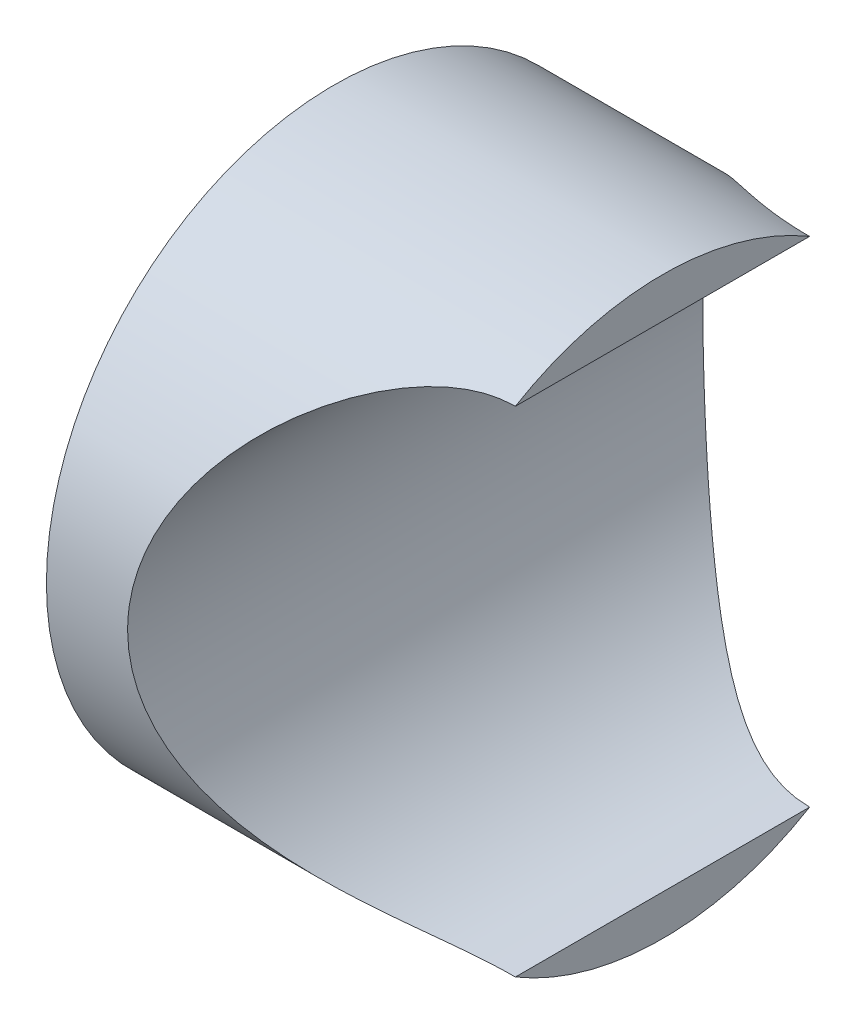
ISO-10303-21;
HEADER;
FILE_DESCRIPTION(('STEP AP214'),'2;1');
FILE_NAME('part.step','',(''),(''),'','','');
FILE_SCHEMA(('AUTOMOTIVE_DESIGN { 1 0 10303 214 1 1 1 1 }'));
ENDSEC;
DATA;
#1=APPLICATION_CONTEXT('core data for automotive mechanical design processes');
#2=APPLICATION_PROTOCOL_DEFINITION('international standard','automotive_design',2000,#1);
#3=PRODUCT_CONTEXT('',#1,'mechanical');
#4=PRODUCT('Part','Part','',(#3));
#5=PRODUCT_RELATED_PRODUCT_CATEGORY('part','',(#4));
#6=PRODUCT_DEFINITION_FORMATION('','',#4);
#7=PRODUCT_DEFINITION_CONTEXT('part definition',#1,'design');
#8=PRODUCT_DEFINITION('design','',#6,#7);
#9=PRODUCT_DEFINITION_SHAPE('','',#8);
#10=(LENGTH_UNIT() NAMED_UNIT(*) SI_UNIT(.MILLI.,.METRE.));
#11=(NAMED_UNIT(*) PLANE_ANGLE_UNIT() SI_UNIT($,.RADIAN.));
#12=(NAMED_UNIT(*) SI_UNIT($,.STERADIAN.) SOLID_ANGLE_UNIT());
#13=UNCERTAINTY_MEASURE_WITH_UNIT(LENGTH_MEASURE(1.E-05),#10,'distance_accuracy_value','');
#14=(GEOMETRIC_REPRESENTATION_CONTEXT(3) GLOBAL_UNCERTAINTY_ASSIGNED_CONTEXT((#13)) GLOBAL_UNIT_ASSIGNED_CONTEXT((#10,
#11,#12)) REPRESENTATION_CONTEXT('',''));
#15=CARTESIAN_POINT('',(0.,0.,0.));
#16=DIRECTION('',(0.,0.,1.));
#17=DIRECTION('',(1.,0.,0.));
#18=AXIS2_PLACEMENT_3D('',#15,#16,#17);
#19=CARTESIAN_POINT('',(12.7807869250002,0.,0.));
#20=DIRECTION('',(1.,0.,0.));
#21=DIRECTION('',(0.,0.,-1.));
#22=AXIS2_PLACEMENT_3D('',#19,#20,#21);
#23=CONICAL_SURFACE('',#22,11.125644094549,1.57046118111369);
#24=CARTESIAN_POINT('',(12.7818191652309,-11.4999972503782,8.33964425478237));
#25=CARTESIAN_POINT('',(12.7815867865613,-11.4999974113096,7.15584265215765));
#26=CARTESIAN_POINT('',(12.7813859967241,-11.4999975429495,5.97204104025673));
#27=CARTESIAN_POINT('',(12.7810802586463,-11.4999977385602,3.60443780639245));
#28=CARTESIAN_POINT('',(12.7809753104056,-11.499997802531,2.42063618442908));
#29=CARTESIAN_POINT('',(12.7808532239762,-11.4999978793107,-1.1307686466761));
#30=CARTESIAN_POINT('',(12.7810288440698,-11.4999977769868,-3.49837186379628));
#31=CARTESIAN_POINT('',(12.781508813234,-11.499997460868,-6.69053145480797));
#32=CARTESIAN_POINT('',(12.7816546694613,-11.4999973631853,-7.51508785772023));
#33=CARTESIAN_POINT('',(12.7818191652309,-11.4999972503782,-8.3396442547823));
#34=B_SPLINE_CURVE_WITH_KNOTS('',3,(#24,#25,#26,#27,#28,#29,#30,#31,#32,#33),.UNSPECIFIED.,.F.,
.F.,(4,2,2,2,4),(0.,3.5514048807471,7.10280975587456,14.2056193778395,16.6792886228623),.UNSPECIFIED.);
#35=CARTESIAN_POINT('',(12.7815435070281,-11.4999974376966,6.84527983333938));
#36=VERTEX_POINT('',#35);
#37=CARTESIAN_POINT('',(12.7815435070281,-11.4999974376966,-6.84527983333938));
#38=VERTEX_POINT('',#37);
#39=EDGE_CURVE('E56',#36,#38,#34,.T.);
#40=ORIENTED_EDGE('',*,*,#39,.F.);
#41=CARTESIAN_POINT('',(12.7815435070281,0.,0.));
#42=DIRECTION('',(-1.,0.,0.));
#43=DIRECTION('',(0.,0.,1.));
#44=AXIS2_PLACEMENT_3D('',#41,#42,#43);
#45=CIRCLE('',#44,13.3831161193405);
#46=EDGE_CURVE('E71',#38,#36,#45,.T.);
#47=ORIENTED_EDGE('',*,*,#46,.F.);
#48=EDGE_LOOP('',(#40,#47));
#49=FACE_BOUND('',#48,.T.);
#50=ADVANCED_FACE('F36',(#49),#23,.F.);
#51=CARTESIAN_POINT('',(12.7818191652309,11.499997250379,-8.33964425478125));
#52=CARTESIAN_POINT('',(12.7815867865613,11.4999974113103,-7.15584265215653));
#53=CARTESIAN_POINT('',(12.7813859967241,11.4999975429502,-5.97204104025562));
#54=CARTESIAN_POINT('',(12.7810802586463,11.4999977385609,-3.60443780639133));
#55=CARTESIAN_POINT('',(12.7809753104056,11.4999978025318,-2.42063618442796));
#56=CARTESIAN_POINT('',(12.7808532239762,11.4999978793115,1.13076864667721));
#57=CARTESIAN_POINT('',(12.7810288440698,11.4999977769875,3.4983718637974));
#58=CARTESIAN_POINT('',(12.781508813234,11.4999974608688,6.69053145480838));
#59=CARTESIAN_POINT('',(12.7816546694613,11.499997363186,7.51508785771995));
#60=CARTESIAN_POINT('',(12.7818191652309,11.499997250379,8.33964425478131));
#61=B_SPLINE_CURVE_WITH_KNOTS('',3,(#51,#52,#53,#54,#55,#56,#57,#58,#59,#60),.UNSPECIFIED.,.F.,
.F.,(4,2,2,2,4),(0.,3.5514048807471,7.10280975587456,14.2056193778395,16.6792886228602),.UNSPECIFIED.);
#62=CARTESIAN_POINT('',(12.7815435070281,11.4999974376974,-6.8452798333381));
#63=VERTEX_POINT('',#62);
#64=CARTESIAN_POINT('',(12.7815435070281,11.4999974376974,6.8452798333381));
#65=VERTEX_POINT('',#64);
#66=EDGE_CURVE('E51',#63,#65,#61,.T.);
#67=ORIENTED_EDGE('',*,*,#66,.F.);
#68=EDGE_CURVE('E67',#65,#63,#45,.T.);
#69=ORIENTED_EDGE('',*,*,#68,.F.);
#70=EDGE_LOOP('',(#67,#69));
#71=FACE_BOUND('',#70,.T.);
#72=ADVANCED_FACE('F130',(#71),#23,.F.);
#73=CARTESIAN_POINT('',(0.,0.,0.));
#74=DIRECTION('',(-1.,0.,0.));
#75=DIRECTION('',(0.,0.,1.));
#76=AXIS2_PLACEMENT_3D('',#73,#74,#75);
#77=CYLINDRICAL_SURFACE('',#76,13.3831161193405);
#78=CARTESIAN_POINT('',(-2.50303312003632,0.,0.));
#79=DIRECTION('',(-1.,0.,0.));
#80=DIRECTION('',(0.,0.,1.));
#81=AXIS2_PLACEMENT_3D('',#78,#79,#80);
#82=CIRCLE('',#81,13.3831161193405);
#83=CARTESIAN_POINT('',(-2.50303312003632,0.,13.3831161193405));
#84=VERTEX_POINT('',#83);
#85=EDGE_CURVE('E75',#84,#84,#82,.T.);
#86=ORIENTED_EDGE('',*,*,#85,.F.);
#87=EDGE_LOOP('',(#86));
#88=FACE_BOUND('',#87,.T.);
#89=CARTESIAN_POINT('',(12.7815435070281,-11.4999974376966,-6.84527983333938));
#90=CARTESIAN_POINT('',(12.6844492734243,-11.5000640978706,-6.84516372006474));
#91=CARTESIAN_POINT('',(12.5873683117697,-11.4988970148045,-6.84712896192517));
#92=CARTESIAN_POINT('',(12.3934514320412,-11.4941151595257,-6.85515476819954));
#93=CARTESIAN_POINT('',(12.2966154770082,-11.4905007816905,-6.86121467276514));
#94=CARTESIAN_POINT('',(12.0072129851321,-11.4760386703155,-6.88539809355736));
#95=CARTESIAN_POINT('',(11.8152905539427,-11.4615720615974,-6.90952544711381));
#96=CARTESIAN_POINT('',(11.4379035447013,-11.4236873232043,-6.97197635344641));
#97=CARTESIAN_POINT('',(11.2523848169747,-11.4004149114118,-7.01006851407151));
#98=CARTESIAN_POINT('',(10.8855523388386,-11.3454262301645,-7.09871949243536));
#99=CARTESIAN_POINT('',(10.7042412172839,-11.3137048285163,-7.14928588604953));
#100=CARTESIAN_POINT('',(10.2696353807281,-11.2270577195692,-7.28490976400153));
#101=CARTESIAN_POINT('',(10.0188737207177,-11.1680175869412,-7.37545280264765));
#102=CARTESIAN_POINT('',(9.52779852121387,-11.0352989313623,-7.57258799994504));
#103=CARTESIAN_POINT('',(9.28748973550162,-10.9616138312496,-7.67918736438153));
#104=CARTESIAN_POINT('',(8.81499963275601,-10.8000116868559,-7.90487001626122));
#105=CARTESIAN_POINT('',(8.5829080154037,-10.7119755597859,-8.02405453632131));
#106=CARTESIAN_POINT('',(8.1285721667649,-10.5229162021558,-8.27044024303842));
#107=CARTESIAN_POINT('',(7.90632752384003,-10.4218935151701,-8.39764109404493));
#108=CARTESIAN_POINT('',(7.35596575463084,-10.1505702263501,-8.72581524774253));
#109=CARTESIAN_POINT('',(7.03400753677504,-9.97188383749589,-8.93023119846127));
#110=CARTESIAN_POINT('',(6.41040498706044,-9.58596937963324,-9.34328969810948));
#111=CARTESIAN_POINT('',(6.10877073717269,-9.37872729816613,-9.55193427891752));
#112=CARTESIAN_POINT('',(5.52650635140281,-8.93639101601329,-9.96697014246604));
#113=CARTESIAN_POINT('',(5.24582677486853,-8.70136598827288,-10.1733656802088));
#114=CARTESIAN_POINT('',(4.70564110209142,-8.2029677802378,-10.5793374718869));
#115=CARTESIAN_POINT('',(4.44612617422265,-7.93960653164195,-10.7789165497918));
#116=CARTESIAN_POINT('',(4.00511334657419,-7.44599497187265,-11.1235965366845));
#117=CARTESIAN_POINT('',(3.8190808975904,-7.22136292902104,-11.2709598588323));
#118=CARTESIAN_POINT('',(3.46215460151531,-6.75486877031464,-11.5565703567494));
#119=CARTESIAN_POINT('',(3.29126030136896,-6.51300717049778,-11.6948178053073));
#120=CARTESIAN_POINT('',(2.96635856122278,-6.01262571638068,-11.9597739080112));
#121=CARTESIAN_POINT('',(2.81233284907957,-5.75412437823047,-12.0864950218066));
#122=CARTESIAN_POINT('',(2.52279896186515,-5.22088062830393,-12.3262158760311));
#123=CARTESIAN_POINT('',(2.38728716756638,-4.94614140590782,-12.4392182978018));
#124=CARTESIAN_POINT('',(2.15964940257074,-4.43307483650762,-12.629975927872));
#125=CARTESIAN_POINT('',(2.06411831566319,-4.19724661004799,-12.7104006514744));
#126=CARTESIAN_POINT('',(1.88792749273218,-3.71642985429794,-12.8592085181029));
#127=CARTESIAN_POINT('',(1.80726478737219,-3.47144316580719,-12.9275940653274));
#128=CARTESIAN_POINT('',(1.66193885790047,-2.97359535940437,-13.051102335458));
#129=CARTESIAN_POINT('',(1.59726937918351,-2.72073736348646,-13.1062302429071));
#130=CARTESIAN_POINT('',(1.48489678449071,-2.20859183870976,-13.2021885972922));
#131=CARTESIAN_POINT('',(1.43719385879935,-1.94930423777609,-13.2430188838764));
#132=CARTESIAN_POINT('',(1.35938371901443,-1.42484869139586,-13.3096887347315));
#133=CARTESIAN_POINT('',(1.32936479510519,-1.15965798729963,-13.3354530752511));
#134=CARTESIAN_POINT('',(1.28784946380825,-0.626760078232548,-13.3710985319889));
#135=CARTESIAN_POINT('',(1.27635309691161,-0.359052867761791,-13.3809796134856));
#136=CARTESIAN_POINT('',(1.27210409011458,0.176593948508587,-13.3846307288634));
#137=CARTESIAN_POINT('',(1.2793496555625,0.444533529601315,-13.3784023053255));
#138=CARTESIAN_POINT('',(1.31244178285743,0.978395224410943,-13.349980773652));
#139=CARTESIAN_POINT('',(1.33828749276306,1.24431742996587,-13.3277883967124));
#140=CARTESIAN_POINT('',(1.40534017336956,1.75121156380879,-13.2703022580766));
#141=CARTESIAN_POINT('',(1.44517824533704,1.99250013735901,-13.236176931717));
#142=CARTESIAN_POINT('',(1.53962224034885,2.47001663323076,-13.1554340901125));
#143=CARTESIAN_POINT('',(1.59422721361362,2.70624487996887,-13.1088173782919));
#144=CARTESIAN_POINT('',(1.71744417381135,3.17232159807248,-13.0038930214699));
#145=CARTESIAN_POINT('',(1.78605483055243,3.40217067294754,-12.9455864867205));
#146=CARTESIAN_POINT('',(1.9364537479921,3.8545199785834,-12.8181793300648));
#147=CARTESIAN_POINT('',(2.01824693049249,4.07701742702163,-12.7490746768891));
#148=CARTESIAN_POINT('',(2.2006307630605,4.5299690216163,-12.5955749155418));
#149=CARTESIAN_POINT('',(2.30216620928865,4.75978725320965,-12.510425457927));
#150=CARTESIAN_POINT('',(2.5182870585206,5.20915733422823,-12.3300924942077));
#151=CARTESIAN_POINT('',(2.63287759740811,5.42870509499755,-12.2349050402502));
#152=CARTESIAN_POINT('',(2.99469762136384,6.07118748736319,-11.9361338633591));
#153=CARTESIAN_POINT('',(3.26000920094789,6.4780434840719,-11.7193127196827));
#154=CARTESIAN_POINT('',(3.76034498568633,7.15097097889591,-11.3174658899078));
#155=CARTESIAN_POINT('',(3.98664638366361,7.42698397205888,-11.1378277670744));
#156=CARTESIAN_POINT('',(4.46007043659276,7.95336810728357,-10.768243493491));
#157=CARTESIAN_POINT('',(4.70720268339957,8.20372731784259,-10.5782926085715));
#158=CARTESIAN_POINT('',(5.22112589340591,8.67922835498355,-10.1918060105807));
#159=CARTESIAN_POINT('',(5.48795969611764,8.90431237595215,-9.9952564869938));
#160=CARTESIAN_POINT('',(6.03994648720726,9.32874670229502,-9.60032324442569));
#161=CARTESIAN_POINT('',(6.32509398269286,9.52810467029144,-9.40194009055353));
#162=CARTESIAN_POINT('',(6.85541353606286,9.864071897844,-9.04738376773619));
#163=CARTESIAN_POINT('',(7.097300719571,10.0052850778057,-8.89064094874128));
#164=CARTESIAN_POINT('',(7.59341890354969,10.270938700919,-8.5823650188978));
#165=CARTESIAN_POINT('',(7.84765208875987,10.3953761606312,-8.43083283828342));
#166=CARTESIAN_POINT('',(8.3686072764572,10.6266026221072,-8.13743794075082));
#167=CARTESIAN_POINT('',(8.63529934207137,10.7334313916024,-7.99555387261206));
#168=CARTESIAN_POINT('',(9.18232403668568,10.9286414117643,-7.72658943336854));
#169=CARTESIAN_POINT('',(9.46264693880247,11.0170355857681,-7.59949871937737));
#170=CARTESIAN_POINT('',(10.1012277592139,11.1910164673492,-7.34153730205881));
#171=CARTESIAN_POINT('',(10.4631023991511,11.2717428702389,-7.21594167204668));
#172=CARTESIAN_POINT('',(11.0195331183961,11.3669534541355,-7.06425896978547));
#173=CARTESIAN_POINT('',(11.206977165992,11.3943544843158,-7.01985729272766));
#174=CARTESIAN_POINT('',(11.5857094428891,11.4400431861856,-6.94515152713506));
#175=CARTESIAN_POINT('',(11.7769950586153,11.45833684914,-6.91483817149847));
#176=CARTESIAN_POINT('',(12.1039049005886,11.4812589619177,-6.87668772660925));
#177=CARTESIAN_POINT('',(12.2389001032943,11.4883455337336,-6.86482800940809));
#178=CARTESIAN_POINT('',(12.509768263665,11.4977697376404,-6.84902238876611));
#179=CARTESIAN_POINT('',(12.6456423886471,11.5000984902512,-6.8450912826034));
#180=CARTESIAN_POINT('',(12.7815435070281,11.4999974376974,-6.8452798333381));
#181=B_SPLINE_CURVE_WITH_KNOTS('',3,(#89,#90,#91,#92,#93,#94,#95,#96,#97,#98,#99,#100,#101,#102,
#103,#104,#105,#106,#107,#108,#109,#110,#111,#112,#113,#114,#115,#116,#117,#118,#119,#120,#121,
#122,#123,#124,#125,#126,#127,#128,#129,#130,#131,#132,#133,#134,#135,#136,#137,#138,#139,#140,
#141,#142,#143,#144,#145,#146,#147,#148,#149,#150,#151,#152,#153,#154,#155,#156,#157,#158,#159,
#160,#161,#162,#163,#164,#165,#166,#167,#168,#169,#170,#171,#172,#173,#174,#175,#176,#177,#178,
#179,#180),.UNSPECIFIED.,.F.,.F.,(4,2,2,2,2,2,2,2,2,2,2,2,2,2,2,2,2,2,2,2,2,2,2,2,2,2,2,2,2,2,2,
2,2,2,2,2,2,2,2,2,2,2,2,2,2,4),(0.,0.291221393096976,0.582395867521592,1.16336704616943,
1.73511736459956,2.30721577810868,3.12505436614294,3.9432610848075,4.76863942789967,
5.59398323463872,6.85575691437991,8.11815197418768,9.37746766750194,10.6362551533631,
11.615751056178,12.5952176346928,13.5736125313987,14.5518158902535,15.3515928314715,
16.1512098772799,16.9505137138737,17.7498265145943,18.5530969121973,19.3563690657791,
20.1595643041135,20.962722756082,21.7026773010219,22.4425842647787,23.1824209884289,
23.9225345786883,24.7176032856529,25.512985860413,27.1034733556487,28.3008360386271,
29.4987531077871,30.6993563523391,31.8996011622532,32.8618508872361,33.8242715161917,
34.7844879018189,35.7440288603189,36.9138478149326,37.4969427533609,38.0796535952958,
38.4864563493176,38.8940176250915),.UNSPECIFIED.);
#182=EDGE_CURVE('E44',#38,#63,#181,.T.);
#183=ORIENTED_EDGE('',*,*,#182,.F.);
#184=ORIENTED_EDGE('',*,*,#46,.T.);
#185=CARTESIAN_POINT('',(12.7815435070281,11.4999974376974,6.8452798333381));
#186=CARTESIAN_POINT('',(12.6844492734243,11.5000640978714,6.84516372006345));
#187=CARTESIAN_POINT('',(12.5873683117697,11.4988970148053,6.84712896192389));
#188=CARTESIAN_POINT('',(12.3934514320412,11.4941151595265,6.85515476819826));
#189=CARTESIAN_POINT('',(12.2966154770083,11.4905007816912,6.86121467276386));
#190=CARTESIAN_POINT('',(12.0072129851322,11.4760386703163,6.88539809355608));
#191=CARTESIAN_POINT('',(11.8152905539428,11.4615720615982,6.90952544711252));
#192=CARTESIAN_POINT('',(11.4379035447015,11.423687323205,6.97197635344512));
#193=CARTESIAN_POINT('',(11.2523848169749,11.4004149114126,7.01006851407022));
#194=CARTESIAN_POINT('',(10.8855523388388,11.3454262301653,7.09871949243407));
#195=CARTESIAN_POINT('',(10.7042412172842,11.3137048285171,7.14928588604824));
#196=CARTESIAN_POINT('',(10.2696353807284,11.22705771957,7.28490976400024));
#197=CARTESIAN_POINT('',(10.0188737207181,11.1680175869421,7.37545280264636));
#198=CARTESIAN_POINT('',(9.52779852121429,11.0352989313631,7.57258799994375));
#199=CARTESIAN_POINT('',(9.28748973550207,10.9616138312505,7.67918736438024));
#200=CARTESIAN_POINT('',(8.8149996327565,10.8000116868568,7.90487001625993));
#201=CARTESIAN_POINT('',(8.58290801540421,10.7119755597868,8.02405453632002));
#202=CARTESIAN_POINT('',(8.12857216676546,10.5229162021568,8.27044024303714));
#203=CARTESIAN_POINT('',(7.90632752384061,10.4218935151711,8.39764109404365));
#204=CARTESIAN_POINT('',(7.35596575463142,10.1505702263512,8.72581524774128));
#205=CARTESIAN_POINT('',(7.0340075367756,9.97188383749697,8.93023119846006));
#206=CARTESIAN_POINT('',(6.41040498706096,9.58596937963435,9.34328969810835));
#207=CARTESIAN_POINT('',(6.10877073717319,9.37872729816725,9.55193427891643));
#208=CARTESIAN_POINT('',(5.52650635140327,8.93639101601442,9.96697014246502));
#209=CARTESIAN_POINT('',(5.24582677486897,8.70136598827403,10.1733656802079));
#210=CARTESIAN_POINT('',(4.70564110209182,8.20296778023896,10.579337471886));
#211=CARTESIAN_POINT('',(4.44612617422303,7.93960653164311,10.7789165497909));
#212=CARTESIAN_POINT('',(4.00511334657454,7.44599497187382,11.1235965366837));
#213=CARTESIAN_POINT('',(3.81908089759073,7.22136292902222,11.2709598588315));
#214=CARTESIAN_POINT('',(3.46215460151562,6.75486877031582,11.5565703567488));
#215=CARTESIAN_POINT('',(3.29126030136924,6.51300717049896,11.6948178053066));
#216=CARTESIAN_POINT('',(2.96635856122303,6.01262571638185,11.9597739080106));
#217=CARTESIAN_POINT('',(2.81233284907981,5.75412437823164,12.086495021806));
#218=CARTESIAN_POINT('',(2.52279896186536,5.22088062830509,12.3262158760307));
#219=CARTESIAN_POINT('',(2.38728716756657,4.94614140590898,12.4392182978013));
#220=CARTESIAN_POINT('',(2.15964940257091,4.43307483650878,12.6299759278716));
#221=CARTESIAN_POINT('',(2.06411831566334,4.19724661004914,12.710400651474));
#222=CARTESIAN_POINT('',(1.88792749273231,3.7164298542991,12.8592085181025));
#223=CARTESIAN_POINT('',(1.80726478737231,3.47144316580835,12.9275940653271));
#224=CARTESIAN_POINT('',(1.66193885790057,2.97359535940553,13.0511023354577));
#225=CARTESIAN_POINT('',(1.59726937918361,2.72073736348761,13.1062302429069));
#226=CARTESIAN_POINT('',(1.48489678449078,2.2085918387109,13.202188597292));
#227=CARTESIAN_POINT('',(1.43719385879941,1.94930423777723,13.2430188838762));
#228=CARTESIAN_POINT('',(1.35938371901447,1.42484869139699,13.3096887347314));
#229=CARTESIAN_POINT('',(1.32936479510522,1.15965798730076,13.335453075251));
#230=CARTESIAN_POINT('',(1.28784946380827,0.626760078233659,13.3710985319888));
#231=CARTESIAN_POINT('',(1.27635309691162,0.359052867762893,13.3809796134856));
#232=CARTESIAN_POINT('',(1.27210409011458,-0.176593948507507,13.3846307288634));
#233=CARTESIAN_POINT('',(1.27934965556249,-0.444533529600246,13.3784023053256));
#234=CARTESIAN_POINT('',(1.31244178285741,-0.978395224409896,13.3499807736521));
#235=CARTESIAN_POINT('',(1.33828749276303,-1.24431742996483,13.3277883967125));
#236=CARTESIAN_POINT('',(1.40534017336952,-1.75121156380777,13.2703022580767));
#237=CARTESIAN_POINT('',(1.44517824533699,-1.99250013735799,13.2361769317172));
#238=CARTESIAN_POINT('',(1.5396222403488,-2.47001663322975,13.1554340901127));
#239=CARTESIAN_POINT('',(1.59422721361356,-2.70624487996788,13.1088173782921));
#240=CARTESIAN_POINT('',(1.71744417381128,-3.17232159807149,13.0038930214701));
#241=CARTESIAN_POINT('',(1.78605483055236,-3.40217067294656,12.9455864867207));
#242=CARTESIAN_POINT('',(1.93645374799203,-3.85451997858243,12.8181793300651));
#243=CARTESIAN_POINT('',(2.01824693049241,-4.07701742702066,12.7490746768894));
#244=CARTESIAN_POINT('',(2.20063076306042,-4.52996902161534,12.5955749155421));
#245=CARTESIAN_POINT('',(2.30216620928856,-4.75978725320869,12.5104254579274));
#246=CARTESIAN_POINT('',(2.51828705852051,-5.20915733422728,12.3300924942081));
#247=CARTESIAN_POINT('',(2.63287759740801,-5.4287050949966,12.2349050402506));
#248=CARTESIAN_POINT('',(2.99469762136373,-6.07118748736224,11.9361338633596));
#249=CARTESIAN_POINT('',(3.26000920094777,-6.47804348407096,11.7193127196833));
#250=CARTESIAN_POINT('',(3.76034498568618,-7.15097097889497,11.3174658899084));
#251=CARTESIAN_POINT('',(3.98664638366345,-7.42698397205793,11.137827767075));
#252=CARTESIAN_POINT('',(4.46007043659257,-7.95336810728261,10.7682434934917));
#253=CARTESIAN_POINT('',(4.70720268339937,-8.20372731784163,10.5782926085722));
#254=CARTESIAN_POINT('',(5.22112589340568,-8.67922835498259,10.1918060105815));
#255=CARTESIAN_POINT('',(5.48795969611739,-8.90431237595119,9.99525648699466));
#256=CARTESIAN_POINT('',(6.03994648720699,-9.32874670229407,9.60032324442662));
#257=CARTESIAN_POINT('',(6.32509398269258,-9.52810467029049,9.4019400905545));
#258=CARTESIAN_POINT('',(6.85541353606257,-9.86407189784306,9.04738376773721));
#259=CARTESIAN_POINT('',(7.09730071957073,-10.0052850778048,8.89064094874231));
#260=CARTESIAN_POINT('',(7.59341890354946,-10.2709387009182,8.58236501889886));
#261=CARTESIAN_POINT('',(7.84765208875965,-10.3953761606303,8.43083283828449));
#262=CARTESIAN_POINT('',(8.36860727645702,-10.6266026221063,8.13743794075191));
#263=CARTESIAN_POINT('',(8.6352993420712,-10.7334313916015,7.99555387261317));
#264=CARTESIAN_POINT('',(9.18232403668555,-10.9286414117635,7.72658943336968));
#265=CARTESIAN_POINT('',(9.46264693880236,-11.0170355857673,7.59949871937853));
#266=CARTESIAN_POINT('',(10.1012277592139,-11.1910164673484,7.34153730205998));
#267=CARTESIAN_POINT('',(10.4631023991511,-11.2717428702382,7.21594167204787));
#268=CARTESIAN_POINT('',(11.0195331183962,-11.3669534541348,7.06425896978668));
#269=CARTESIAN_POINT('',(11.2069771659921,-11.3943544843151,7.01985729272887));
#270=CARTESIAN_POINT('',(11.5857094428892,-11.4400431861849,6.94515152713628));
#271=CARTESIAN_POINT('',(11.7769950586155,-11.4583368491393,6.91483817149971));
#272=CARTESIAN_POINT('',(12.1039049005888,-11.4812589619169,6.8766877266105));
#273=CARTESIAN_POINT('',(12.2389001032944,-11.4883455337329,6.86482800940936));
#274=CARTESIAN_POINT('',(12.509768263665,-11.4977697376396,6.84902238876739));
#275=CARTESIAN_POINT('',(12.6456423886471,-11.5000984902505,6.84509128260468));
#276=CARTESIAN_POINT('',(12.7815435070281,-11.4999974376966,6.84527983333937));
#277=B_SPLINE_CURVE_WITH_KNOTS('',3,(#185,#186,#187,#188,#189,#190,#191,#192,#193,#194,#195,
#196,#197,#198,#199,#200,#201,#202,#203,#204,#205,#206,#207,#208,#209,#210,#211,#212,#213,#214,
#215,#216,#217,#218,#219,#220,#221,#222,#223,#224,#225,#226,#227,#228,#229,#230,#231,#232,#233,
#234,#235,#236,#237,#238,#239,#240,#241,#242,#243,#244,#245,#246,#247,#248,#249,#250,#251,#252,
#253,#254,#255,#256,#257,#258,#259,#260,#261,#262,#263,#264,#265,#266,#267,#268,#269,#270,#271,
#272,#273,#274,#275,#276),.UNSPECIFIED.,.F.,.F.,(4,2,2,2,2,2,2,2,2,2,2,2,2,2,2,2,2,2,2,2,2,2,2,
2,2,2,2,2,2,2,2,2,2,2,2,2,2,2,2,2,2,2,2,2,2,4),(0.,0.291221393096937,0.582395867521513,
1.16336704616927,1.73511736459932,2.30721577810836,3.12505436614254,3.94326108480703,
4.76863942789912,5.59398323463809,6.85575691437936,8.11815197418722,9.37746766750156,
10.6362551533628,11.6157510561778,12.5952176346926,13.5736125313986,14.5518158902534,
15.3515928314715,16.1512098772799,16.9505137138738,17.7498265145944,18.5530969121974,
19.3563690657793,20.1595643041136,20.9627227560822,21.7026773010221,22.4425842647789,
23.1824209884291,23.9225345786885,24.7176032856531,25.5129858604131,27.1034733556488,
28.3008360386271,29.498753107787,30.699356352339,31.899601162253,32.8618508872359,
33.8242715161916,34.7844879018188,35.7440288603188,36.9138478149326,37.4969427533611,
38.079653595296,38.4864563493177,38.8940176250915),.UNSPECIFIED.);
#278=EDGE_CURVE('E61',#65,#36,#277,.T.);
#279=ORIENTED_EDGE('',*,*,#278,.F.);
#280=ORIENTED_EDGE('',*,*,#68,.T.);
#281=EDGE_LOOP('',(#183,#184,#279,#280));
#282=FACE_BOUND('',#281,.T.);
#283=ADVANCED_FACE('F74',(#88,#282),#77,.T.);
#284=CARTESIAN_POINT('',(-3.74721783915236,0.,0.));
#285=DIRECTION('',(-1.,0.,0.));
#286=DIRECTION('',(0.,0.,1.));
#287=AXIS2_PLACEMENT_3D('',#284,#285,#286);
#288=TOROIDAL_SURFACE('',#287,13.3150962550643,1.24604266267974);
#289=CARTESIAN_POINT('',(-2.50613327366593,0.,0.));
#290=DIRECTION('',(-1.,0.,0.));
#291=DIRECTION('',(0.,0.,1.));
#292=AXIS2_PLACEMENT_3D('',#289,#290,#291);
#293=CIRCLE('',#292,13.2040493346686);
#294=CARTESIAN_POINT('',(-2.50613327366593,0.,13.2040493346686));
#295=VERTEX_POINT('',#294);
#296=EDGE_CURVE('E78',#295,#295,#293,.T.);
#297=ORIENTED_EDGE('',*,*,#296,.F.);
#298=EDGE_LOOP('',(#297));
#299=FACE_BOUND('',#298,.T.);
#300=ORIENTED_EDGE('',*,*,#85,.T.);
#301=EDGE_LOOP('',(#300));
#302=FACE_BOUND('',#301,.T.);
#303=ADVANCED_FACE('F124',(#299,#302),#288,.F.);
#304=CARTESIAN_POINT('',(-2.50613327366593,0.,-13.2040493346686));
#305=DIRECTION('',(1.,0.,0.));
#306=DIRECTION('',(0.,0.,-1.));
#307=AXIS2_PLACEMENT_3D('',#304,#305,#306);
#308=PLANE('',#307);
#309=CARTESIAN_POINT('',(-2.50613327366593,0.,0.));
#310=DIRECTION('',(-1.,0.,0.));
#311=DIRECTION('',(0.,0.,1.));
#312=AXIS2_PLACEMENT_3D('',#309,#310,#311);
#313=CIRCLE('',#312,9.63773693985803);
#314=CARTESIAN_POINT('',(-2.50613327366593,0.,9.63773693985803));
#315=VERTEX_POINT('',#314);
#316=EDGE_CURVE('E117',#315,#315,#313,.T.);
#317=ORIENTED_EDGE('',*,*,#316,.F.);
#318=EDGE_LOOP('',(#317));
#319=FACE_BOUND('',#318,.T.);
#320=ORIENTED_EDGE('',*,*,#296,.T.);
#321=EDGE_LOOP('',(#320));
#322=FACE_BOUND('',#321,.T.);
#323=ADVANCED_FACE('F122',(#319,#322),#308,.F.);
#324=CARTESIAN_POINT('',(0.,0.,0.));
#325=DIRECTION('',(-1.,0.,0.));
#326=DIRECTION('',(0.,0.,1.));
#327=AXIS2_PLACEMENT_3D('',#324,#325,#326);
#328=CYLINDRICAL_SURFACE('',#327,9.63773693985803);
#329=CARTESIAN_POINT('',(0.,0.,0.));
#330=DIRECTION('',(-1.,0.,0.));
#331=DIRECTION('',(0.,0.,1.));
#332=AXIS2_PLACEMENT_3D('',#329,#330,#331);
#333=CIRCLE('',#332,9.63773693985803);
#334=CARTESIAN_POINT('',(0.,0.,9.63773693985803));
#335=VERTEX_POINT('',#334);
#336=EDGE_CURVE('E72',#335,#335,#333,.T.);
#337=ORIENTED_EDGE('',*,*,#336,.F.);
#338=EDGE_LOOP('',(#337));
#339=FACE_BOUND('',#338,.T.);
#340=ORIENTED_EDGE('',*,*,#316,.T.);
#341=EDGE_LOOP('',(#340));
#342=FACE_BOUND('',#341,.T.);
#343=ADVANCED_FACE('F164',(#339,#342),#328,.F.);
#344=CARTESIAN_POINT('',(0.,0.,-3.705));
#345=DIRECTION('',(1.,0.,0.));
#346=DIRECTION('',(0.,0.,-1.));
#347=AXIS2_PLACEMENT_3D('',#344,#345,#346);
#348=PLANE('',#347);
#349=CARTESIAN_POINT('',(0.,0.,0.));
#350=DIRECTION('',(1.,0.,0.));
#351=DIRECTION('',(0.,0.,-1.));
#352=AXIS2_PLACEMENT_3D('',#349,#350,#351);
#353=CIRCLE('',#352,5.);
#354=CARTESIAN_POINT('',(0.,0.,-5.));
#355=VERTEX_POINT('',#354);
#356=EDGE_CURVE('E11',#355,#355,#353,.F.);
#357=ORIENTED_EDGE('',*,*,#356,.F.);
#358=EDGE_LOOP('',(#357));
#359=FACE_BOUND('',#358,.T.);
#360=ORIENTED_EDGE('',*,*,#336,.T.);
#361=EDGE_LOOP('',(#360));
#362=FACE_BOUND('',#361,.T.);
#363=ADVANCED_FACE('F97',(#359,#362),#348,.F.);
#364=CARTESIAN_POINT('',(12.7738667263341,3.82066069320314E-13,-16.0777536654389));
#365=DIRECTION('',(0.,0.,-1.));
#366=DIRECTION('',(0.,1.,0.));
#367=AXIS2_PLACEMENT_3D('',#364,#365,#366);
#368=CYLINDRICAL_SURFACE('',#367,11.5);
#369=ORIENTED_EDGE('',*,*,#182,.T.);
#370=ORIENTED_EDGE('',*,*,#66,.T.);
#371=ORIENTED_EDGE('',*,*,#278,.T.);
#372=ORIENTED_EDGE('',*,*,#39,.T.);
#373=EDGE_LOOP('',(#369,#370,#371,#372));
#374=FACE_BOUND('',#373,.T.);
#375=ADVANCED_FACE('F62',(#374),#368,.F.);
#376=CARTESIAN_POINT('',(-2.,0.,0.));
#377=DIRECTION('',(1.,0.,0.));
#378=DIRECTION('',(0.,0.,-1.));
#379=AXIS2_PLACEMENT_3D('',#376,#377,#378);
#380=CYLINDRICAL_SURFACE('',#379,5.);
#381=CARTESIAN_POINT('',(-2.,0.,0.));
#382=DIRECTION('',(-1.,0.,0.));
#383=DIRECTION('',(0.,0.,1.));
#384=AXIS2_PLACEMENT_3D('',#381,#382,#383);
#385=CIRCLE('',#384,5.);
#386=CARTESIAN_POINT('',(-2.,0.,5.));
#387=VERTEX_POINT('',#386);
#388=EDGE_CURVE('E109',#387,#387,#385,.T.);
#389=ORIENTED_EDGE('',*,*,#388,.F.);
#390=EDGE_LOOP('',(#389));
#391=FACE_BOUND('',#390,.T.);
#392=ORIENTED_EDGE('',*,*,#356,.T.);
#393=EDGE_LOOP('',(#392));
#394=FACE_BOUND('',#393,.T.);
#395=ADVANCED_FACE('F96',(#391,#394),#380,.T.);
#396=CARTESIAN_POINT('',(-2.,0.,0.));
#397=DIRECTION('',(-1.,0.,0.));
#398=DIRECTION('',(0.,0.,1.));
#399=AXIS2_PLACEMENT_3D('',#396,#397,#398);
#400=PLANE('',#399);
#401=ORIENTED_EDGE('',*,*,#388,.T.);
#402=EDGE_LOOP('',(#401));
#403=FACE_BOUND('',#402,.T.);
#404=ADVANCED_FACE('F173',(#403),#400,.T.);
#405=CLOSED_SHELL('',(#50,#72,#283,#303,#323,#343,#363,#375,#395,#404));
#406=MANIFOLD_SOLID_BREP('B2',#405);
#407=ADVANCED_BREP_SHAPE_REPRESENTATION('',(#18,#406),#14);
#408=SHAPE_DEFINITION_REPRESENTATION(#9,#407);
ENDSEC;
END-ISO-10303-21;
